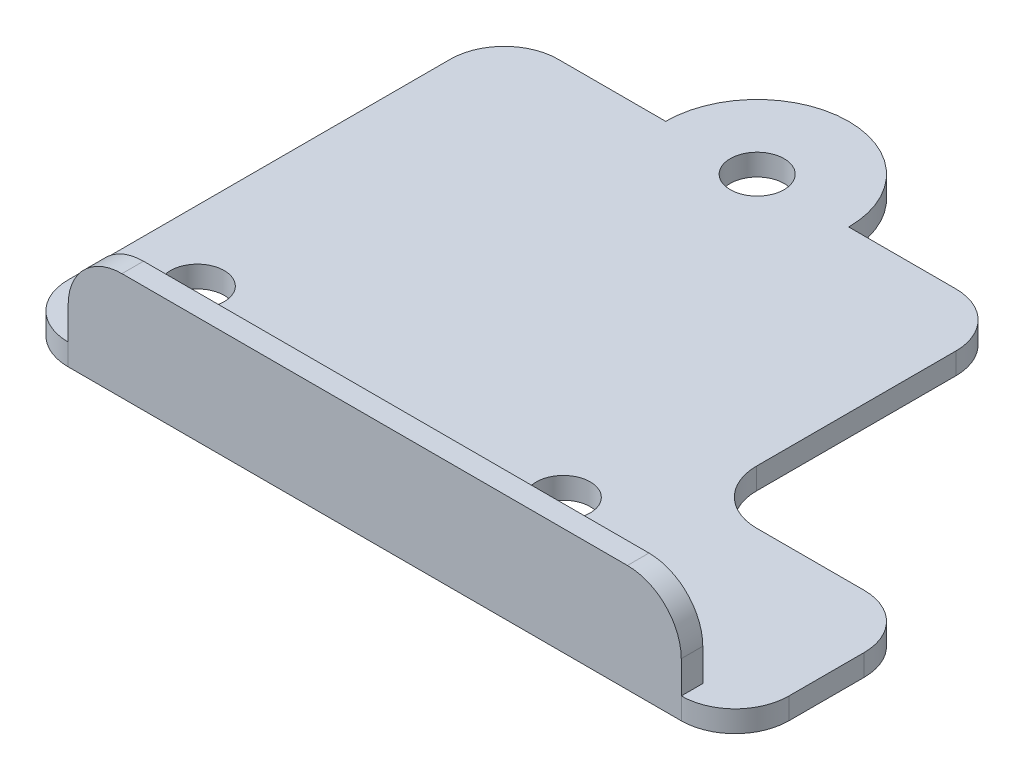
ISO-10303-21;
HEADER;
FILE_DESCRIPTION(('STEP AP214'),'2;1');
FILE_NAME('part.step','',(''),(''),'','','');
FILE_SCHEMA(('AUTOMOTIVE_DESIGN { 1 0 10303 214 1 1 1 1 }'));
ENDSEC;
DATA;
#1=APPLICATION_CONTEXT('core data for automotive mechanical design processes');
#2=APPLICATION_PROTOCOL_DEFINITION('international standard','automotive_design',2000,#1);
#3=PRODUCT_CONTEXT('',#1,'mechanical');
#4=PRODUCT('Part','Part','',(#3));
#5=PRODUCT_RELATED_PRODUCT_CATEGORY('part','',(#4));
#6=PRODUCT_DEFINITION_FORMATION('','',#4);
#7=PRODUCT_DEFINITION_CONTEXT('part definition',#1,'design');
#8=PRODUCT_DEFINITION('design','',#6,#7);
#9=PRODUCT_DEFINITION_SHAPE('','',#8);
#10=(LENGTH_UNIT() NAMED_UNIT(*) SI_UNIT(.MILLI.,.METRE.));
#11=(NAMED_UNIT(*) PLANE_ANGLE_UNIT() SI_UNIT($,.RADIAN.));
#12=(NAMED_UNIT(*) SI_UNIT($,.STERADIAN.) SOLID_ANGLE_UNIT());
#13=UNCERTAINTY_MEASURE_WITH_UNIT(LENGTH_MEASURE(1.E-05),#10,'distance_accuracy_value','');
#14=(GEOMETRIC_REPRESENTATION_CONTEXT(3) GLOBAL_UNCERTAINTY_ASSIGNED_CONTEXT((#13)) GLOBAL_UNIT_ASSIGNED_CONTEXT((#10,
#11,#12)) REPRESENTATION_CONTEXT('',''));
#15=CARTESIAN_POINT('',(0.,0.,0.));
#16=DIRECTION('',(0.,0.,1.));
#17=DIRECTION('',(1.,0.,0.));
#18=AXIS2_PLACEMENT_3D('',#15,#16,#17);
#19=CARTESIAN_POINT('',(-18.5,2.,14.6634134615385));
#20=DIRECTION('',(0.,1.,0.));
#21=DIRECTION('',(0.,0.,1.));
#22=AXIS2_PLACEMENT_3D('',#19,#20,#21);
#23=PLANE('',#22);
#24=DIRECTION('',(0.,0.,1.));
#25=VECTOR('',#24,1.);
#26=CARTESIAN_POINT('',(-18.5,2.,17.6634134615385));
#27=LINE('',#26,#25);
#28=CARTESIAN_POINT('',(-18.5,2.,17.6634134615385));
#29=VERTEX_POINT('',#28);
#30=CARTESIAN_POINT('',(-18.5,2.,19.6634134615385));
#31=VERTEX_POINT('',#30);
#32=EDGE_CURVE('E190',#29,#31,#27,.T.);
#33=ORIENTED_EDGE('',*,*,#32,.F.);
#34=DIRECTION('',(-1.,0.,0.));
#35=VECTOR('',#34,1.);
#36=CARTESIAN_POINT('',(38.4572609186981,2.,17.6634134615385));
#37=LINE('',#36,#35);
#38=CARTESIAN_POINT('',(38.4572609186981,2.,17.6634134615385));
#39=VERTEX_POINT('',#38);
#40=EDGE_CURVE('E175',#39,#29,#37,.T.);
#41=ORIENTED_EDGE('',*,*,#40,.F.);
#42=DIRECTION('',(0.,0.,-1.));
#43=VECTOR('',#42,1.);
#44=CARTESIAN_POINT('',(38.4572609186981,2.,19.6634134615384));
#45=LINE('',#44,#43);
#46=CARTESIAN_POINT('',(38.4572609186981,2.,19.6634134615384));
#47=VERTEX_POINT('',#46);
#48=EDGE_CURVE('E186',#47,#39,#45,.T.);
#49=ORIENTED_EDGE('',*,*,#48,.F.);
#50=CARTESIAN_POINT('',(38.4572609186981,2.,14.6634134615385));
#51=DIRECTION('',(0.,1.,0.));
#52=DIRECTION('',(0.,0.,1.));
#53=AXIS2_PLACEMENT_3D('',#50,#51,#52);
#54=CIRCLE('',#53,5.);
#55=CARTESIAN_POINT('',(43.4572609186981,2.,14.6634134615385));
#56=VERTEX_POINT('',#55);
#57=EDGE_CURVE('E234',#47,#56,#54,.T.);
#58=ORIENTED_EDGE('',*,*,#57,.T.);
#59=DIRECTION('',(0.,0.,-1.));
#60=VECTOR('',#59,1.);
#61=CARTESIAN_POINT('',(43.4572609186981,2.,14.6634134615385));
#62=LINE('',#61,#60);
#63=CARTESIAN_POINT('',(43.4572609186981,2.,7.66341346153845));
#64=VERTEX_POINT('',#63);
#65=EDGE_CURVE('E237',#56,#64,#62,.T.);
#66=ORIENTED_EDGE('',*,*,#65,.T.);
#67=CARTESIAN_POINT('',(38.4572609186981,2.,7.66341346153845));
#68=DIRECTION('',(0.,1.,0.));
#69=DIRECTION('',(0.,0.,1.));
#70=AXIS2_PLACEMENT_3D('',#67,#68,#69);
#71=CIRCLE('',#70,5.);
#72=CARTESIAN_POINT('',(38.4572609186981,2.,2.66341346153845));
#73=VERTEX_POINT('',#72);
#74=EDGE_CURVE('E241',#64,#73,#71,.T.);
#75=ORIENTED_EDGE('',*,*,#74,.T.);
#76=DIRECTION('',(-1.,0.,0.));
#77=VECTOR('',#76,1.);
#78=CARTESIAN_POINT('',(38.4572609186981,2.,2.66341346153845));
#79=LINE('',#78,#77);
#80=CARTESIAN_POINT('',(28.4572609186981,2.,2.66341346153845));
#81=VERTEX_POINT('',#80);
#82=EDGE_CURVE('E244',#73,#81,#79,.T.);
#83=ORIENTED_EDGE('',*,*,#82,.T.);
#84=CARTESIAN_POINT('',(28.4572609186981,2.,-2.33658653846155));
#85=DIRECTION('',(0.,-1.,0.));
#86=DIRECTION('',(0.,0.,1.));
#87=AXIS2_PLACEMENT_3D('',#84,#85,#86);
#88=CIRCLE('',#87,5.);
#89=CARTESIAN_POINT('',(23.4572609186981,2.,-2.33658653846155));
#90=VERTEX_POINT('',#89);
#91=EDGE_CURVE('E247',#81,#90,#88,.T.);
#92=ORIENTED_EDGE('',*,*,#91,.T.);
#93=DIRECTION('',(0.,0.,-1.));
#94=VECTOR('',#93,1.);
#95=CARTESIAN_POINT('',(23.4572609186981,2.,-20.8465865384615));
#96=LINE('',#95,#94);
#97=CARTESIAN_POINT('',(23.4572609186981,2.,-20.8465865384615));
#98=VERTEX_POINT('',#97);
#99=EDGE_CURVE('E250',#90,#98,#96,.T.);
#100=ORIENTED_EDGE('',*,*,#99,.T.);
#101=CARTESIAN_POINT('',(18.4572609186981,2.,-20.8465865384615));
#102=DIRECTION('',(0.,1.,0.));
#103=DIRECTION('',(0.,0.,-1.));
#104=AXIS2_PLACEMENT_3D('',#101,#102,#103);
#105=CIRCLE('',#104,5.);
#106=CARTESIAN_POINT('',(18.457260918698,2.,-25.8465865384615));
#107=VERTEX_POINT('',#106);
#108=EDGE_CURVE('E253',#98,#107,#105,.T.);
#109=ORIENTED_EDGE('',*,*,#108,.T.);
#110=DIRECTION('',(-1.,0.,0.));
#111=VECTOR('',#110,1.);
#112=CARTESIAN_POINT('',(8.5,2.,-25.8465865384615));
#113=LINE('',#112,#111);
#114=CARTESIAN_POINT('',(8.5,2.,-25.8465865384615));
#115=VERTEX_POINT('',#114);
#116=EDGE_CURVE('E256',#107,#115,#113,.T.);
#117=ORIENTED_EDGE('',*,*,#116,.T.);
#118=CARTESIAN_POINT('',(0.,2.,-25.8465865384615));
#119=DIRECTION('',(0.,1.,0.));
#120=DIRECTION('',(0.,0.,-1.));
#121=AXIS2_PLACEMENT_3D('',#118,#119,#120);
#122=CIRCLE('',#121,8.5);
#123=CARTESIAN_POINT('',(-8.5,2.,-25.8465865384615));
#124=VERTEX_POINT('',#123);
#125=EDGE_CURVE('E259',#115,#124,#122,.T.);
#126=ORIENTED_EDGE('',*,*,#125,.T.);
#127=DIRECTION('',(-1.,0.,0.));
#128=VECTOR('',#127,1.);
#129=CARTESIAN_POINT('',(-18.5,2.,-25.8465865384615));
#130=LINE('',#129,#128);
#131=CARTESIAN_POINT('',(-18.5,2.,-25.8465865384615));
#132=VERTEX_POINT('',#131);
#133=EDGE_CURVE('E262',#124,#132,#130,.T.);
#134=ORIENTED_EDGE('',*,*,#133,.T.);
#135=CARTESIAN_POINT('',(-18.5,2.,-20.8465865384615));
#136=DIRECTION('',(0.,1.,0.));
#137=DIRECTION('',(0.,0.,1.));
#138=AXIS2_PLACEMENT_3D('',#135,#136,#137);
#139=CIRCLE('',#138,5.);
#140=CARTESIAN_POINT('',(-23.5,2.,-20.8465865384615));
#141=VERTEX_POINT('',#140);
#142=EDGE_CURVE('E265',#132,#141,#139,.T.);
#143=ORIENTED_EDGE('',*,*,#142,.T.);
#144=DIRECTION('',(0.,0.,1.));
#145=VECTOR('',#144,1.);
#146=CARTESIAN_POINT('',(-23.5,2.,-20.8465865384615));
#147=LINE('',#146,#145);
#148=CARTESIAN_POINT('',(-23.5,2.,14.6634134615385));
#149=VERTEX_POINT('',#148);
#150=EDGE_CURVE('E268',#141,#149,#147,.T.);
#151=ORIENTED_EDGE('',*,*,#150,.T.);
#152=CARTESIAN_POINT('',(-18.5,2.,14.6634134615385));
#153=DIRECTION('',(0.,1.,0.));
#154=DIRECTION('',(0.,0.,1.));
#155=AXIS2_PLACEMENT_3D('',#152,#153,#154);
#156=CIRCLE('',#155,5.);
#157=EDGE_CURVE('E271',#149,#31,#156,.T.);
#158=ORIENTED_EDGE('',*,*,#157,.T.);
#159=EDGE_LOOP('',(#33,#41,#49,#58,#66,#75,#83,#92,#100,#109,#117,#126,#134,#143,#151,#158));
#160=FACE_BOUND('',#159,.T.);
#161=CARTESIAN_POINT('',(17.,2.,9.16341346153845));
#162=DIRECTION('',(0.,1.,0.));
#163=DIRECTION('',(0.,0.,1.));
#164=AXIS2_PLACEMENT_3D('',#161,#162,#163);
#165=CIRCLE('',#164,2.5);
#166=CARTESIAN_POINT('',(17.,2.,11.6634134615384));
#167=VERTEX_POINT('',#166);
#168=EDGE_CURVE('E218',#167,#167,#165,.T.);
#169=ORIENTED_EDGE('',*,*,#168,.F.);
#170=EDGE_LOOP('',(#169));
#171=FACE_BOUND('',#170,.T.);
#172=CARTESIAN_POINT('',(-17.,2.,9.16341346153845));
#173=DIRECTION('',(0.,1.,0.));
#174=DIRECTION('',(0.,0.,1.));
#175=AXIS2_PLACEMENT_3D('',#172,#173,#174);
#176=CIRCLE('',#175,2.5);
#177=CARTESIAN_POINT('',(-17.,2.,11.6634134615385));
#178=VERTEX_POINT('',#177);
#179=EDGE_CURVE('E226',#178,#178,#176,.T.);
#180=ORIENTED_EDGE('',*,*,#179,.F.);
#181=EDGE_LOOP('',(#180));
#182=FACE_BOUND('',#181,.T.);
#183=CARTESIAN_POINT('',(0.,2.,-25.8465865384615));
#184=DIRECTION('',(0.,1.,0.));
#185=DIRECTION('',(0.,0.,1.));
#186=AXIS2_PLACEMENT_3D('',#183,#184,#185);
#187=CIRCLE('',#186,2.5);
#188=CARTESIAN_POINT('',(0.,2.,-23.3465865384615));
#189=VERTEX_POINT('',#188);
#190=EDGE_CURVE('E210',#189,#189,#187,.T.);
#191=ORIENTED_EDGE('',*,*,#190,.F.);
#192=EDGE_LOOP('',(#191));
#193=FACE_BOUND('',#192,.T.);
#194=ADVANCED_FACE('F39',(#160,#171,#182,#193),#23,.T.);
#195=CARTESIAN_POINT('',(-18.5,0.,14.6634134615385));
#196=DIRECTION('',(0.,1.,0.));
#197=DIRECTION('',(0.,0.,1.));
#198=AXIS2_PLACEMENT_3D('',#195,#196,#197);
#199=PLANE('',#198);
#200=CARTESIAN_POINT('',(38.4572609186981,0.,14.6634134615385));
#201=DIRECTION('',(0.,1.,0.));
#202=DIRECTION('',(0.,0.,1.));
#203=AXIS2_PLACEMENT_3D('',#200,#201,#202);
#204=CIRCLE('',#203,5.);
#205=CARTESIAN_POINT('',(38.4572609186981,0.,19.6634134615384));
#206=VERTEX_POINT('',#205);
#207=CARTESIAN_POINT('',(43.4572609186981,0.,14.6634134615385));
#208=VERTEX_POINT('',#207);
#209=EDGE_CURVE('E230',#206,#208,#204,.T.);
#210=ORIENTED_EDGE('',*,*,#209,.F.);
#211=DIRECTION('',(1.,0.,0.));
#212=VECTOR('',#211,1.);
#213=CARTESIAN_POINT('',(-18.5,0.,19.6634134615385));
#214=LINE('',#213,#212);
#215=CARTESIAN_POINT('',(-18.5,0.,19.6634134615385));
#216=VERTEX_POINT('',#215);
#217=EDGE_CURVE('E238',#216,#206,#214,.T.);
#218=ORIENTED_EDGE('',*,*,#217,.F.);
#219=CARTESIAN_POINT('',(-18.5,0.,14.6634134615385));
#220=DIRECTION('',(0.,1.,0.));
#221=DIRECTION('',(0.,0.,1.));
#222=AXIS2_PLACEMENT_3D('',#219,#220,#221);
#223=CIRCLE('',#222,5.);
#224=CARTESIAN_POINT('',(-23.5,0.,14.6634134615385));
#225=VERTEX_POINT('',#224);
#226=EDGE_CURVE('E310',#225,#216,#223,.T.);
#227=ORIENTED_EDGE('',*,*,#226,.F.);
#228=DIRECTION('',(0.,0.,1.));
#229=VECTOR('',#228,1.);
#230=CARTESIAN_POINT('',(-23.5,0.,-20.8465865384615));
#231=LINE('',#230,#229);
#232=CARTESIAN_POINT('',(-23.5,0.,-20.8465865384615));
#233=VERTEX_POINT('',#232);
#234=EDGE_CURVE('E307',#233,#225,#231,.T.);
#235=ORIENTED_EDGE('',*,*,#234,.F.);
#236=CARTESIAN_POINT('',(-18.5,0.,-20.8465865384615));
#237=DIRECTION('',(0.,1.,0.));
#238=DIRECTION('',(0.,0.,1.));
#239=AXIS2_PLACEMENT_3D('',#236,#237,#238);
#240=CIRCLE('',#239,5.);
#241=CARTESIAN_POINT('',(-18.5,0.,-25.8465865384615));
#242=VERTEX_POINT('',#241);
#243=EDGE_CURVE('E304',#242,#233,#240,.T.);
#244=ORIENTED_EDGE('',*,*,#243,.F.);
#245=DIRECTION('',(-1.,0.,0.));
#246=VECTOR('',#245,1.);
#247=CARTESIAN_POINT('',(-18.5,0.,-25.8465865384615));
#248=LINE('',#247,#246);
#249=CARTESIAN_POINT('',(-8.5,0.,-25.8465865384615));
#250=VERTEX_POINT('',#249);
#251=EDGE_CURVE('E301',#250,#242,#248,.T.);
#252=ORIENTED_EDGE('',*,*,#251,.F.);
#253=CARTESIAN_POINT('',(0.,0.,-25.8465865384615));
#254=DIRECTION('',(0.,1.,0.));
#255=DIRECTION('',(0.,0.,-1.));
#256=AXIS2_PLACEMENT_3D('',#253,#254,#255);
#257=CIRCLE('',#256,8.5);
#258=CARTESIAN_POINT('',(8.5,0.,-25.8465865384615));
#259=VERTEX_POINT('',#258);
#260=EDGE_CURVE('E298',#259,#250,#257,.T.);
#261=ORIENTED_EDGE('',*,*,#260,.F.);
#262=DIRECTION('',(-1.,0.,0.));
#263=VECTOR('',#262,1.);
#264=CARTESIAN_POINT('',(8.5,0.,-25.8465865384615));
#265=LINE('',#264,#263);
#266=CARTESIAN_POINT('',(18.457260918698,0.,-25.8465865384615));
#267=VERTEX_POINT('',#266);
#268=EDGE_CURVE('E295',#267,#259,#265,.T.);
#269=ORIENTED_EDGE('',*,*,#268,.F.);
#270=CARTESIAN_POINT('',(18.4572609186981,0.,-20.8465865384615));
#271=DIRECTION('',(0.,1.,0.));
#272=DIRECTION('',(0.,0.,-1.));
#273=AXIS2_PLACEMENT_3D('',#270,#271,#272);
#274=CIRCLE('',#273,5.);
#275=CARTESIAN_POINT('',(23.4572609186981,0.,-20.8465865384615));
#276=VERTEX_POINT('',#275);
#277=EDGE_CURVE('E292',#276,#267,#274,.T.);
#278=ORIENTED_EDGE('',*,*,#277,.F.);
#279=DIRECTION('',(0.,0.,-1.));
#280=VECTOR('',#279,1.);
#281=CARTESIAN_POINT('',(23.4572609186981,0.,-20.8465865384615));
#282=LINE('',#281,#280);
#283=CARTESIAN_POINT('',(23.4572609186981,0.,-2.33658653846155));
#284=VERTEX_POINT('',#283);
#285=EDGE_CURVE('E289',#284,#276,#282,.T.);
#286=ORIENTED_EDGE('',*,*,#285,.F.);
#287=CARTESIAN_POINT('',(28.4572609186981,0.,-2.33658653846155));
#288=DIRECTION('',(0.,-1.,0.));
#289=DIRECTION('',(0.,0.,1.));
#290=AXIS2_PLACEMENT_3D('',#287,#288,#289);
#291=CIRCLE('',#290,5.);
#292=CARTESIAN_POINT('',(28.4572609186981,0.,2.66341346153845));
#293=VERTEX_POINT('',#292);
#294=EDGE_CURVE('E286',#293,#284,#291,.T.);
#295=ORIENTED_EDGE('',*,*,#294,.F.);
#296=DIRECTION('',(-1.,0.,0.));
#297=VECTOR('',#296,1.);
#298=CARTESIAN_POINT('',(38.4572609186981,0.,2.66341346153845));
#299=LINE('',#298,#297);
#300=CARTESIAN_POINT('',(38.4572609186981,0.,2.66341346153845));
#301=VERTEX_POINT('',#300);
#302=EDGE_CURVE('E283',#301,#293,#299,.T.);
#303=ORIENTED_EDGE('',*,*,#302,.F.);
#304=CARTESIAN_POINT('',(38.4572609186981,0.,7.66341346153845));
#305=DIRECTION('',(0.,1.,0.));
#306=DIRECTION('',(0.,0.,1.));
#307=AXIS2_PLACEMENT_3D('',#304,#305,#306);
#308=CIRCLE('',#307,5.);
#309=CARTESIAN_POINT('',(43.4572609186981,0.,7.66341346153845));
#310=VERTEX_POINT('',#309);
#311=EDGE_CURVE('E280',#310,#301,#308,.T.);
#312=ORIENTED_EDGE('',*,*,#311,.F.);
#313=DIRECTION('',(0.,0.,-1.));
#314=VECTOR('',#313,1.);
#315=CARTESIAN_POINT('',(43.4572609186981,0.,14.6634134615385));
#316=LINE('',#315,#314);
#317=EDGE_CURVE('E277',#208,#310,#316,.T.);
#318=ORIENTED_EDGE('',*,*,#317,.F.);
#319=EDGE_LOOP('',(#210,#218,#227,#235,#244,#252,#261,#269,#278,#286,#295,#303,#312,#318));
#320=FACE_BOUND('',#319,.T.);
#321=CARTESIAN_POINT('',(-17.,0.,9.16341346153845));
#322=DIRECTION('',(0.,1.,0.));
#323=DIRECTION('',(0.,0.,1.));
#324=AXIS2_PLACEMENT_3D('',#321,#322,#323);
#325=CIRCLE('',#324,2.5);
#326=CARTESIAN_POINT('',(-17.,0.,11.6634134615385));
#327=VERTEX_POINT('',#326);
#328=EDGE_CURVE('E222',#327,#327,#325,.T.);
#329=ORIENTED_EDGE('',*,*,#328,.T.);
#330=EDGE_LOOP('',(#329));
#331=FACE_BOUND('',#330,.T.);
#332=CARTESIAN_POINT('',(17.,0.,9.16341346153845));
#333=DIRECTION('',(0.,1.,0.));
#334=DIRECTION('',(0.,0.,1.));
#335=AXIS2_PLACEMENT_3D('',#332,#333,#334);
#336=CIRCLE('',#335,2.5);
#337=CARTESIAN_POINT('',(17.,0.,11.6634134615384));
#338=VERTEX_POINT('',#337);
#339=EDGE_CURVE('E214',#338,#338,#336,.T.);
#340=ORIENTED_EDGE('',*,*,#339,.T.);
#341=EDGE_LOOP('',(#340));
#342=FACE_BOUND('',#341,.T.);
#343=CARTESIAN_POINT('',(0.,0.,-25.8465865384615));
#344=DIRECTION('',(0.,1.,0.));
#345=DIRECTION('',(0.,0.,1.));
#346=AXIS2_PLACEMENT_3D('',#343,#344,#345);
#347=CIRCLE('',#346,2.5);
#348=CARTESIAN_POINT('',(0.,0.,-23.3465865384615));
#349=VERTEX_POINT('',#348);
#350=EDGE_CURVE('E209',#349,#349,#347,.T.);
#351=ORIENTED_EDGE('',*,*,#350,.T.);
#352=EDGE_LOOP('',(#351));
#353=FACE_BOUND('',#352,.T.);
#354=ADVANCED_FACE('F408',(#320,#331,#342,#353),#199,.F.);
#355=CARTESIAN_POINT('',(38.4572609186981,2.,14.6634134615385));
#356=DIRECTION('',(0.,-1.,0.));
#357=DIRECTION('',(0.,0.,-1.));
#358=AXIS2_PLACEMENT_3D('',#355,#356,#357);
#359=CYLINDRICAL_SURFACE('',#358,5.);
#360=ORIENTED_EDGE('',*,*,#209,.T.);
#361=DIRECTION('',(0.,-1.,0.));
#362=VECTOR('',#361,1.);
#363=CARTESIAN_POINT('',(43.4572609186981,2.,14.6634134615385));
#364=LINE('',#363,#362);
#365=EDGE_CURVE('E362',#56,#208,#364,.T.);
#366=ORIENTED_EDGE('',*,*,#365,.F.);
#367=ORIENTED_EDGE('',*,*,#57,.F.);
#368=DIRECTION('',(0.,-1.,0.));
#369=VECTOR('',#368,1.);
#370=CARTESIAN_POINT('',(38.4572609186981,2.,19.6634134615384));
#371=LINE('',#370,#369);
#372=EDGE_CURVE('E366',#47,#206,#371,.T.);
#373=ORIENTED_EDGE('',*,*,#372,.T.);
#374=EDGE_LOOP('',(#360,#366,#367,#373));
#375=FACE_BOUND('',#374,.T.);
#376=ADVANCED_FACE('F413',(#375),#359,.T.);
#377=CARTESIAN_POINT('',(43.4572609186981,2.,14.6634134615385));
#378=DIRECTION('',(-1.,0.,0.));
#379=DIRECTION('',(0.,0.,1.));
#380=AXIS2_PLACEMENT_3D('',#377,#378,#379);
#381=PLANE('',#380);
#382=ORIENTED_EDGE('',*,*,#317,.T.);
#383=DIRECTION('',(0.,-1.,0.));
#384=VECTOR('',#383,1.);
#385=CARTESIAN_POINT('',(43.4572609186981,2.,7.66341346153845));
#386=LINE('',#385,#384);
#387=EDGE_CURVE('E358',#64,#310,#386,.T.);
#388=ORIENTED_EDGE('',*,*,#387,.F.);
#389=ORIENTED_EDGE('',*,*,#65,.F.);
#390=ORIENTED_EDGE('',*,*,#365,.T.);
#391=EDGE_LOOP('',(#382,#388,#389,#390));
#392=FACE_BOUND('',#391,.T.);
#393=ADVANCED_FACE('F465',(#392),#381,.F.);
#394=CARTESIAN_POINT('',(38.4572609186981,2.,7.66341346153845));
#395=DIRECTION('',(0.,-1.,0.));
#396=DIRECTION('',(0.,0.,-1.));
#397=AXIS2_PLACEMENT_3D('',#394,#395,#396);
#398=CYLINDRICAL_SURFACE('',#397,5.);
#399=ORIENTED_EDGE('',*,*,#311,.T.);
#400=DIRECTION('',(0.,-1.,0.));
#401=VECTOR('',#400,1.);
#402=CARTESIAN_POINT('',(38.4572609186981,2.,2.66341346153845));
#403=LINE('',#402,#401);
#404=EDGE_CURVE('E354',#73,#301,#403,.T.);
#405=ORIENTED_EDGE('',*,*,#404,.F.);
#406=ORIENTED_EDGE('',*,*,#74,.F.);
#407=ORIENTED_EDGE('',*,*,#387,.T.);
#408=EDGE_LOOP('',(#399,#405,#406,#407));
#409=FACE_BOUND('',#408,.T.);
#410=ADVANCED_FACE('F461',(#409),#398,.T.);
#411=CARTESIAN_POINT('',(38.4572609186981,2.,2.66341346153845));
#412=DIRECTION('',(0.,0.,1.));
#413=DIRECTION('',(1.,0.,0.));
#414=AXIS2_PLACEMENT_3D('',#411,#412,#413);
#415=PLANE('',#414);
#416=ORIENTED_EDGE('',*,*,#302,.T.);
#417=DIRECTION('',(0.,-1.,0.));
#418=VECTOR('',#417,1.);
#419=CARTESIAN_POINT('',(28.4572609186981,2.,2.66341346153845));
#420=LINE('',#419,#418);
#421=EDGE_CURVE('E350',#81,#293,#420,.T.);
#422=ORIENTED_EDGE('',*,*,#421,.F.);
#423=ORIENTED_EDGE('',*,*,#82,.F.);
#424=ORIENTED_EDGE('',*,*,#404,.T.);
#425=EDGE_LOOP('',(#416,#422,#423,#424));
#426=FACE_BOUND('',#425,.T.);
#427=ADVANCED_FACE('F457',(#426),#415,.F.);
#428=CARTESIAN_POINT('',(28.4572609186981,2.,-2.33658653846155));
#429=DIRECTION('',(0.,-1.,0.));
#430=DIRECTION('',(0.,0.,-1.));
#431=AXIS2_PLACEMENT_3D('',#428,#429,#430);
#432=CYLINDRICAL_SURFACE('',#431,5.);
#433=ORIENTED_EDGE('',*,*,#294,.T.);
#434=DIRECTION('',(0.,-1.,0.));
#435=VECTOR('',#434,1.);
#436=CARTESIAN_POINT('',(23.4572609186981,2.,-2.33658653846155));
#437=LINE('',#436,#435);
#438=EDGE_CURVE('E346',#90,#284,#437,.T.);
#439=ORIENTED_EDGE('',*,*,#438,.F.);
#440=ORIENTED_EDGE('',*,*,#91,.F.);
#441=ORIENTED_EDGE('',*,*,#421,.T.);
#442=EDGE_LOOP('',(#433,#439,#440,#441));
#443=FACE_BOUND('',#442,.T.);
#444=ADVANCED_FACE('F453',(#443),#432,.F.);
#445=CARTESIAN_POINT('',(23.4572609186981,2.,-20.8465865384615));
#446=DIRECTION('',(-1.,0.,0.));
#447=DIRECTION('',(0.,0.,1.));
#448=AXIS2_PLACEMENT_3D('',#445,#446,#447);
#449=PLANE('',#448);
#450=ORIENTED_EDGE('',*,*,#285,.T.);
#451=DIRECTION('',(0.,-1.,0.));
#452=VECTOR('',#451,1.);
#453=CARTESIAN_POINT('',(23.4572609186981,2.,-20.8465865384615));
#454=LINE('',#453,#452);
#455=EDGE_CURVE('E342',#98,#276,#454,.T.);
#456=ORIENTED_EDGE('',*,*,#455,.F.);
#457=ORIENTED_EDGE('',*,*,#99,.F.);
#458=ORIENTED_EDGE('',*,*,#438,.T.);
#459=EDGE_LOOP('',(#450,#456,#457,#458));
#460=FACE_BOUND('',#459,.T.);
#461=ADVANCED_FACE('F449',(#460),#449,.F.);
#462=CARTESIAN_POINT('',(18.4572609186981,2.,-20.8465865384615));
#463=DIRECTION('',(0.,-1.,0.));
#464=DIRECTION('',(0.,0.,-1.));
#465=AXIS2_PLACEMENT_3D('',#462,#463,#464);
#466=CYLINDRICAL_SURFACE('',#465,5.);
#467=ORIENTED_EDGE('',*,*,#277,.T.);
#468=DIRECTION('',(0.,-1.,0.));
#469=VECTOR('',#468,1.);
#470=CARTESIAN_POINT('',(18.457260918698,2.,-25.8465865384615));
#471=LINE('',#470,#469);
#472=EDGE_CURVE('E338',#107,#267,#471,.T.);
#473=ORIENTED_EDGE('',*,*,#472,.F.);
#474=ORIENTED_EDGE('',*,*,#108,.F.);
#475=ORIENTED_EDGE('',*,*,#455,.T.);
#476=EDGE_LOOP('',(#467,#473,#474,#475));
#477=FACE_BOUND('',#476,.T.);
#478=ADVANCED_FACE('F445',(#477),#466,.T.);
#479=CARTESIAN_POINT('',(8.5,2.,-25.8465865384615));
#480=DIRECTION('',(0.,0.,1.));
#481=DIRECTION('',(1.,0.,0.));
#482=AXIS2_PLACEMENT_3D('',#479,#480,#481);
#483=PLANE('',#482);
#484=ORIENTED_EDGE('',*,*,#268,.T.);
#485=DIRECTION('',(0.,-1.,0.));
#486=VECTOR('',#485,1.);
#487=CARTESIAN_POINT('',(8.5,2.,-25.8465865384615));
#488=LINE('',#487,#486);
#489=EDGE_CURVE('E334',#115,#259,#488,.T.);
#490=ORIENTED_EDGE('',*,*,#489,.F.);
#491=ORIENTED_EDGE('',*,*,#116,.F.);
#492=ORIENTED_EDGE('',*,*,#472,.T.);
#493=EDGE_LOOP('',(#484,#490,#491,#492));
#494=FACE_BOUND('',#493,.T.);
#495=ADVANCED_FACE('F441',(#494),#483,.F.);
#496=CARTESIAN_POINT('',(0.,2.,-25.8465865384615));
#497=DIRECTION('',(0.,-1.,0.));
#498=DIRECTION('',(0.,0.,-1.));
#499=AXIS2_PLACEMENT_3D('',#496,#497,#498);
#500=CYLINDRICAL_SURFACE('',#499,8.5);
#501=ORIENTED_EDGE('',*,*,#260,.T.);
#502=DIRECTION('',(0.,-1.,0.));
#503=VECTOR('',#502,1.);
#504=CARTESIAN_POINT('',(-8.5,2.,-25.8465865384615));
#505=LINE('',#504,#503);
#506=EDGE_CURVE('E330',#124,#250,#505,.T.);
#507=ORIENTED_EDGE('',*,*,#506,.F.);
#508=ORIENTED_EDGE('',*,*,#125,.F.);
#509=ORIENTED_EDGE('',*,*,#489,.T.);
#510=EDGE_LOOP('',(#501,#507,#508,#509));
#511=FACE_BOUND('',#510,.T.);
#512=ADVANCED_FACE('F437',(#511),#500,.T.);
#513=CARTESIAN_POINT('',(-18.5,2.,-25.8465865384615));
#514=DIRECTION('',(0.,0.,1.));
#515=DIRECTION('',(1.,0.,0.));
#516=AXIS2_PLACEMENT_3D('',#513,#514,#515);
#517=PLANE('',#516);
#518=ORIENTED_EDGE('',*,*,#251,.T.);
#519=DIRECTION('',(0.,-1.,0.));
#520=VECTOR('',#519,1.);
#521=CARTESIAN_POINT('',(-18.5,2.,-25.8465865384615));
#522=LINE('',#521,#520);
#523=EDGE_CURVE('E326',#132,#242,#522,.T.);
#524=ORIENTED_EDGE('',*,*,#523,.F.);
#525=ORIENTED_EDGE('',*,*,#133,.F.);
#526=ORIENTED_EDGE('',*,*,#506,.T.);
#527=EDGE_LOOP('',(#518,#524,#525,#526));
#528=FACE_BOUND('',#527,.T.);
#529=ADVANCED_FACE('F433',(#528),#517,.F.);
#530=CARTESIAN_POINT('',(-18.5,2.,-20.8465865384615));
#531=DIRECTION('',(0.,-1.,0.));
#532=DIRECTION('',(0.,0.,-1.));
#533=AXIS2_PLACEMENT_3D('',#530,#531,#532);
#534=CYLINDRICAL_SURFACE('',#533,5.);
#535=ORIENTED_EDGE('',*,*,#243,.T.);
#536=DIRECTION('',(0.,-1.,0.));
#537=VECTOR('',#536,1.);
#538=CARTESIAN_POINT('',(-23.5,2.,-20.8465865384615));
#539=LINE('',#538,#537);
#540=EDGE_CURVE('E322',#141,#233,#539,.T.);
#541=ORIENTED_EDGE('',*,*,#540,.F.);
#542=ORIENTED_EDGE('',*,*,#142,.F.);
#543=ORIENTED_EDGE('',*,*,#523,.T.);
#544=EDGE_LOOP('',(#535,#541,#542,#543));
#545=FACE_BOUND('',#544,.T.);
#546=ADVANCED_FACE('F429',(#545),#534,.T.);
#547=CARTESIAN_POINT('',(-23.5,2.,-20.8465865384615));
#548=DIRECTION('',(1.,0.,0.));
#549=DIRECTION('',(0.,0.,-1.));
#550=AXIS2_PLACEMENT_3D('',#547,#548,#549);
#551=PLANE('',#550);
#552=ORIENTED_EDGE('',*,*,#234,.T.);
#553=DIRECTION('',(0.,-1.,0.));
#554=VECTOR('',#553,1.);
#555=CARTESIAN_POINT('',(-23.5,2.,14.6634134615385));
#556=LINE('',#555,#554);
#557=EDGE_CURVE('E318',#149,#225,#556,.T.);
#558=ORIENTED_EDGE('',*,*,#557,.F.);
#559=ORIENTED_EDGE('',*,*,#150,.F.);
#560=ORIENTED_EDGE('',*,*,#540,.T.);
#561=EDGE_LOOP('',(#552,#558,#559,#560));
#562=FACE_BOUND('',#561,.T.);
#563=ADVANCED_FACE('F425',(#562),#551,.F.);
#564=CARTESIAN_POINT('',(-18.5,2.,14.6634134615385));
#565=DIRECTION('',(0.,-1.,0.));
#566=DIRECTION('',(0.,0.,-1.));
#567=AXIS2_PLACEMENT_3D('',#564,#565,#566);
#568=CYLINDRICAL_SURFACE('',#567,5.);
#569=ORIENTED_EDGE('',*,*,#226,.T.);
#570=DIRECTION('',(0.,-1.,0.));
#571=VECTOR('',#570,1.);
#572=CARTESIAN_POINT('',(-18.5,2.,19.6634134615385));
#573=LINE('',#572,#571);
#574=EDGE_CURVE('E274',#31,#216,#573,.T.);
#575=ORIENTED_EDGE('',*,*,#574,.F.);
#576=ORIENTED_EDGE('',*,*,#157,.F.);
#577=ORIENTED_EDGE('',*,*,#557,.T.);
#578=EDGE_LOOP('',(#569,#575,#576,#577));
#579=FACE_BOUND('',#578,.T.);
#580=ADVANCED_FACE('F422',(#579),#568,.T.);
#581=CARTESIAN_POINT('',(-18.5,2.,19.6634134615385));
#582=DIRECTION('',(0.,0.,-1.));
#583=DIRECTION('',(-1.,0.,0.));
#584=AXIS2_PLACEMENT_3D('',#581,#582,#583);
#585=PLANE('',#584);
#586=DIRECTION('',(0.,-1.,0.));
#587=VECTOR('',#586,1.);
#588=CARTESIAN_POINT('',(38.4572609186981,10.,19.6634134615384));
#589=LINE('',#588,#587);
#590=CARTESIAN_POINT('',(38.4572609186981,5.,19.6634134615384));
#591=VERTEX_POINT('',#590);
#592=EDGE_CURVE('E179',#591,#47,#589,.T.);
#593=ORIENTED_EDGE('',*,*,#592,.F.);
#594=CARTESIAN_POINT('',(33.4572609186981,5.,19.6634134615385));
#595=DIRECTION('',(0.,0.,-1.));
#596=DIRECTION('',(-1.,0.,0.));
#597=AXIS2_PLACEMENT_3D('',#594,#595,#596);
#598=CIRCLE('',#597,5.);
#599=CARTESIAN_POINT('',(33.4572609186981,10.,19.6634134615384));
#600=VERTEX_POINT('',#599);
#601=EDGE_CURVE('E48',#591,#600,#598,.F.);
#602=ORIENTED_EDGE('',*,*,#601,.T.);
#603=DIRECTION('',(1.,0.,0.));
#604=VECTOR('',#603,1.);
#605=CARTESIAN_POINT('',(-18.5,10.,19.6634134615385));
#606=LINE('',#605,#604);
#607=CARTESIAN_POINT('',(-13.5,10.,19.6634134615385));
#608=VERTEX_POINT('',#607);
#609=EDGE_CURVE('E192',#608,#600,#606,.T.);
#610=ORIENTED_EDGE('',*,*,#609,.F.);
#611=CARTESIAN_POINT('',(-13.5,5.,19.6634134615385));
#612=DIRECTION('',(0.,0.,-1.));
#613=DIRECTION('',(-1.,0.,0.));
#614=AXIS2_PLACEMENT_3D('',#611,#612,#613);
#615=CIRCLE('',#614,5.);
#616=CARTESIAN_POINT('',(-18.5,5.,19.6634134615385));
#617=VERTEX_POINT('',#616);
#618=EDGE_CURVE('E55',#608,#617,#615,.F.);
#619=ORIENTED_EDGE('',*,*,#618,.T.);
#620=DIRECTION('',(0.,-1.,0.));
#621=VECTOR('',#620,1.);
#622=CARTESIAN_POINT('',(-18.5,10.,19.6634134615385));
#623=LINE('',#622,#621);
#624=EDGE_CURVE('E206',#617,#31,#623,.T.);
#625=ORIENTED_EDGE('',*,*,#624,.T.);
#626=ORIENTED_EDGE('',*,*,#574,.T.);
#627=ORIENTED_EDGE('',*,*,#217,.T.);
#628=ORIENTED_EDGE('',*,*,#372,.F.);
#629=EDGE_LOOP('',(#593,#602,#610,#619,#625,#626,#627,#628));
#630=FACE_BOUND('',#629,.T.);
#631=ADVANCED_FACE('F389',(#630),#585,.F.);
#632=CARTESIAN_POINT('',(-17.,2.,9.16341346153845));
#633=DIRECTION('',(0.,-1.,0.));
#634=DIRECTION('',(0.,0.,-1.));
#635=AXIS2_PLACEMENT_3D('',#632,#633,#634);
#636=CYLINDRICAL_SURFACE('',#635,2.5);
#637=ORIENTED_EDGE('',*,*,#179,.T.);
#638=EDGE_LOOP('',(#637));
#639=FACE_BOUND('',#638,.T.);
#640=ORIENTED_EDGE('',*,*,#328,.F.);
#641=EDGE_LOOP('',(#640));
#642=FACE_BOUND('',#641,.T.);
#643=ADVANCED_FACE('F417',(#639,#642),#636,.F.);
#644=CARTESIAN_POINT('',(17.,2.,9.16341346153845));
#645=DIRECTION('',(0.,-1.,0.));
#646=DIRECTION('',(0.,0.,-1.));
#647=AXIS2_PLACEMENT_3D('',#644,#645,#646);
#648=CYLINDRICAL_SURFACE('',#647,2.5);
#649=ORIENTED_EDGE('',*,*,#168,.T.);
#650=EDGE_LOOP('',(#649));
#651=FACE_BOUND('',#650,.T.);
#652=ORIENTED_EDGE('',*,*,#339,.F.);
#653=EDGE_LOOP('',(#652));
#654=FACE_BOUND('',#653,.T.);
#655=ADVANCED_FACE('F527',(#651,#654),#648,.F.);
#656=CARTESIAN_POINT('',(0.,2.,-25.8465865384615));
#657=DIRECTION('',(0.,-1.,0.));
#658=DIRECTION('',(0.,0.,-1.));
#659=AXIS2_PLACEMENT_3D('',#656,#657,#658);
#660=CYLINDRICAL_SURFACE('',#659,2.5);
#661=ORIENTED_EDGE('',*,*,#190,.T.);
#662=EDGE_LOOP('',(#661));
#663=FACE_BOUND('',#662,.T.);
#664=ORIENTED_EDGE('',*,*,#350,.F.);
#665=EDGE_LOOP('',(#664));
#666=FACE_BOUND('',#665,.T.);
#667=ADVANCED_FACE('F520',(#663,#666),#660,.F.);
#668=CARTESIAN_POINT('',(-18.5,10.,17.6634134615385));
#669=DIRECTION('',(1.,0.,0.));
#670=DIRECTION('',(0.,0.,-1.));
#671=AXIS2_PLACEMENT_3D('',#668,#669,#670);
#672=PLANE('',#671);
#673=ORIENTED_EDGE('',*,*,#624,.F.);
#674=DIRECTION('',(0.,0.,1.));
#675=VECTOR('',#674,1.);
#676=CARTESIAN_POINT('',(-18.5,5.,17.6634134615385));
#677=LINE('',#676,#675);
#678=CARTESIAN_POINT('',(-18.5,5.,17.6634134615385));
#679=VERTEX_POINT('',#678);
#680=EDGE_CURVE('E11',#617,#679,#677,.F.);
#681=ORIENTED_EDGE('',*,*,#680,.T.);
#682=DIRECTION('',(0.,-1.,0.));
#683=VECTOR('',#682,1.);
#684=CARTESIAN_POINT('',(-18.5,10.,17.6634134615385));
#685=LINE('',#684,#683);
#686=EDGE_CURVE('E180',#679,#29,#685,.T.);
#687=ORIENTED_EDGE('',*,*,#686,.T.);
#688=ORIENTED_EDGE('',*,*,#32,.T.);
#689=EDGE_LOOP('',(#673,#681,#687,#688));
#690=FACE_BOUND('',#689,.T.);
#691=ADVANCED_FACE('F515',(#690),#672,.F.);
#692=CARTESIAN_POINT('',(38.4572609186981,10.,19.6634134615384));
#693=DIRECTION('',(-1.,0.,0.));
#694=DIRECTION('',(0.,0.,1.));
#695=AXIS2_PLACEMENT_3D('',#692,#693,#694);
#696=PLANE('',#695);
#697=DIRECTION('',(0.,-1.,0.));
#698=VECTOR('',#697,1.);
#699=CARTESIAN_POINT('',(38.4572609186981,10.,17.6634134615385));
#700=LINE('',#699,#698);
#701=CARTESIAN_POINT('',(38.4572609186981,5.,17.6634134615385));
#702=VERTEX_POINT('',#701);
#703=EDGE_CURVE('E170',#702,#39,#700,.T.);
#704=ORIENTED_EDGE('',*,*,#703,.F.);
#705=DIRECTION('',(0.,0.,-1.));
#706=VECTOR('',#705,1.);
#707=CARTESIAN_POINT('',(38.4572609186981,5.,19.6634134615384));
#708=LINE('',#707,#706);
#709=EDGE_CURVE('E63',#702,#591,#708,.F.);
#710=ORIENTED_EDGE('',*,*,#709,.T.);
#711=ORIENTED_EDGE('',*,*,#592,.T.);
#712=ORIENTED_EDGE('',*,*,#48,.T.);
#713=EDGE_LOOP('',(#704,#710,#711,#712));
#714=FACE_BOUND('',#713,.T.);
#715=ADVANCED_FACE('F194',(#714),#696,.F.);
#716=CARTESIAN_POINT('',(38.4572609186981,10.,17.6634134615385));
#717=DIRECTION('',(0.,0.,1.));
#718=DIRECTION('',(1.,0.,0.));
#719=AXIS2_PLACEMENT_3D('',#716,#717,#718);
#720=PLANE('',#719);
#721=DIRECTION('',(-1.,0.,0.));
#722=VECTOR('',#721,1.);
#723=CARTESIAN_POINT('',(38.4572609186981,10.,17.6634134615385));
#724=LINE('',#723,#722);
#725=CARTESIAN_POINT('',(33.4572609186981,10.,17.6634134615385));
#726=VERTEX_POINT('',#725);
#727=CARTESIAN_POINT('',(-13.5,10.,17.6634134615385));
#728=VERTEX_POINT('',#727);
#729=EDGE_CURVE('E202',#726,#728,#724,.T.);
#730=ORIENTED_EDGE('',*,*,#729,.F.);
#731=CARTESIAN_POINT('',(33.4572609186981,5.,17.6634134615385));
#732=DIRECTION('',(0.,0.,1.));
#733=DIRECTION('',(1.,0.,0.));
#734=AXIS2_PLACEMENT_3D('',#731,#732,#733);
#735=CIRCLE('',#734,5.);
#736=EDGE_CURVE('E176',#726,#702,#735,.F.);
#737=ORIENTED_EDGE('',*,*,#736,.T.);
#738=ORIENTED_EDGE('',*,*,#703,.T.);
#739=ORIENTED_EDGE('',*,*,#40,.T.);
#740=ORIENTED_EDGE('',*,*,#686,.F.);
#741=CARTESIAN_POINT('',(-13.5,5.,17.6634134615385));
#742=DIRECTION('',(0.,0.,1.));
#743=DIRECTION('',(1.,0.,0.));
#744=AXIS2_PLACEMENT_3D('',#741,#742,#743);
#745=CIRCLE('',#744,5.);
#746=EDGE_CURVE('E378',#679,#728,#745,.F.);
#747=ORIENTED_EDGE('',*,*,#746,.T.);
#748=EDGE_LOOP('',(#730,#737,#738,#739,#740,#747));
#749=FACE_BOUND('',#748,.T.);
#750=ADVANCED_FACE('F173',(#749),#720,.F.);
#751=CARTESIAN_POINT('',(0.,10.,0.));
#752=DIRECTION('',(0.,1.,0.));
#753=DIRECTION('',(0.,0.,1.));
#754=AXIS2_PLACEMENT_3D('',#751,#752,#753);
#755=PLANE('',#754);
#756=ORIENTED_EDGE('',*,*,#609,.T.);
#757=DIRECTION('',(0.,0.,-1.));
#758=VECTOR('',#757,1.);
#759=CARTESIAN_POINT('',(33.4572609186981,10.,17.6634134615385));
#760=LINE('',#759,#758);
#761=EDGE_CURVE('E374',#600,#726,#760,.T.);
#762=ORIENTED_EDGE('',*,*,#761,.T.);
#763=ORIENTED_EDGE('',*,*,#729,.T.);
#764=DIRECTION('',(0.,0.,1.));
#765=VECTOR('',#764,1.);
#766=CARTESIAN_POINT('',(-13.5,10.,19.6634134615385));
#767=LINE('',#766,#765);
#768=EDGE_CURVE('E370',#728,#608,#767,.T.);
#769=ORIENTED_EDGE('',*,*,#768,.T.);
#770=EDGE_LOOP('',(#756,#762,#763,#769));
#771=FACE_BOUND('',#770,.T.);
#772=ADVANCED_FACE('F393',(#771),#755,.T.);
#773=CARTESIAN_POINT('',(33.4572609186981,5.,0.));
#774=DIRECTION('',(0.,0.,1.));
#775=DIRECTION('',(1.,0.,0.));
#776=AXIS2_PLACEMENT_3D('',#773,#774,#775);
#777=CYLINDRICAL_SURFACE('',#776,5.);
#778=ORIENTED_EDGE('',*,*,#601,.F.);
#779=ORIENTED_EDGE('',*,*,#709,.F.);
#780=ORIENTED_EDGE('',*,*,#736,.F.);
#781=ORIENTED_EDGE('',*,*,#761,.F.);
#782=EDGE_LOOP('',(#778,#779,#780,#781));
#783=FACE_BOUND('',#782,.T.);
#784=ADVANCED_FACE('F398',(#783),#777,.T.);
#785=CARTESIAN_POINT('',(-13.5,5.,0.));
#786=DIRECTION('',(0.,0.,-1.));
#787=DIRECTION('',(-1.,0.,0.));
#788=AXIS2_PLACEMENT_3D('',#785,#786,#787);
#789=CYLINDRICAL_SURFACE('',#788,5.);
#790=ORIENTED_EDGE('',*,*,#746,.F.);
#791=ORIENTED_EDGE('',*,*,#680,.F.);
#792=ORIENTED_EDGE('',*,*,#618,.F.);
#793=ORIENTED_EDGE('',*,*,#768,.F.);
#794=EDGE_LOOP('',(#790,#791,#792,#793));
#795=FACE_BOUND('',#794,.T.);
#796=ADVANCED_FACE('F41',(#795),#789,.T.);
#797=CLOSED_SHELL('',(#194,#354,#376,#393,#410,#427,#444,#461,#478,#495,#512,#529,#546,#563,
#580,#631,#643,#655,#667,#691,#715,#750,#772,#784,#796));
#798=MANIFOLD_SOLID_BREP('B2',#797);
#799=ADVANCED_BREP_SHAPE_REPRESENTATION('',(#18,#798),#14);
#800=SHAPE_DEFINITION_REPRESENTATION(#9,#799);
ENDSEC;
END-ISO-10303-21;
